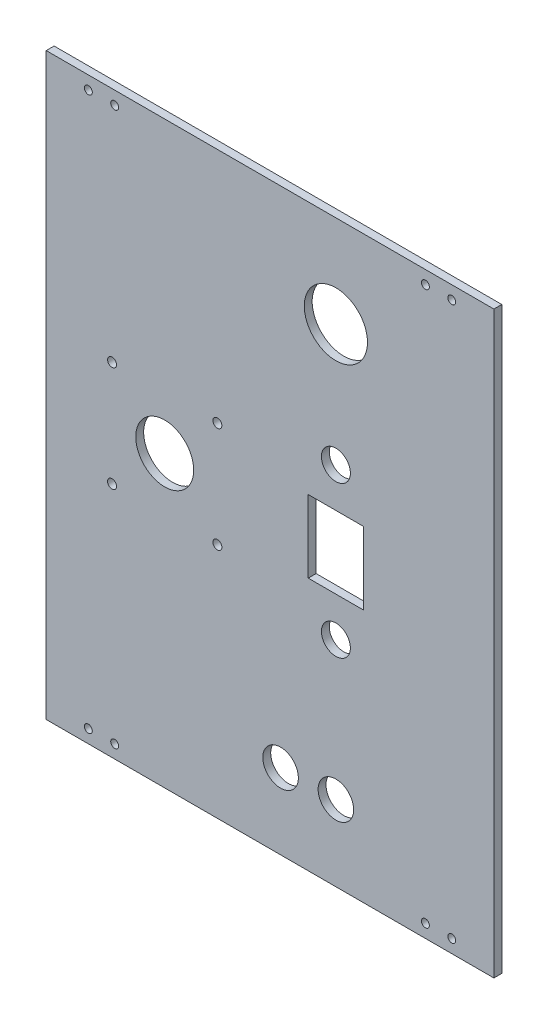
ISO-10303-21;
HEADER;
FILE_DESCRIPTION(('STEP AP214'),'2;1');
FILE_NAME('part.step','',(''),(''),'','','');
FILE_SCHEMA(('AUTOMOTIVE_DESIGN { 1 0 10303 214 1 1 1 1 }'));
ENDSEC;
DATA;
#1=APPLICATION_CONTEXT('core data for automotive mechanical design processes');
#2=APPLICATION_PROTOCOL_DEFINITION('international standard','automotive_design',2000,#1);
#3=PRODUCT_CONTEXT('',#1,'mechanical');
#4=PRODUCT('Part','Part','',(#3));
#5=PRODUCT_RELATED_PRODUCT_CATEGORY('part','',(#4));
#6=PRODUCT_DEFINITION_FORMATION('','',#4);
#7=PRODUCT_DEFINITION_CONTEXT('part definition',#1,'design');
#8=PRODUCT_DEFINITION('design','',#6,#7);
#9=PRODUCT_DEFINITION_SHAPE('','',#8);
#10=(LENGTH_UNIT() NAMED_UNIT(*) SI_UNIT(.MILLI.,.METRE.));
#11=(NAMED_UNIT(*) PLANE_ANGLE_UNIT() SI_UNIT($,.RADIAN.));
#12=(NAMED_UNIT(*) SI_UNIT($,.STERADIAN.) SOLID_ANGLE_UNIT());
#13=UNCERTAINTY_MEASURE_WITH_UNIT(LENGTH_MEASURE(1.E-05),#10,'distance_accuracy_value','');
#14=(GEOMETRIC_REPRESENTATION_CONTEXT(3) GLOBAL_UNCERTAINTY_ASSIGNED_CONTEXT((#13)) GLOBAL_UNIT_ASSIGNED_CONTEXT((#10,
#11,#12)) REPRESENTATION_CONTEXT('',''));
#15=CARTESIAN_POINT('',(0.,0.,0.));
#16=DIRECTION('',(0.,0.,1.));
#17=DIRECTION('',(1.,0.,0.));
#18=AXIS2_PLACEMENT_3D('',#15,#16,#17);
#19=CARTESIAN_POINT('',(99.8748036559118,-179.78014735229,3.));
#20=DIRECTION('',(0.,0.,-1.));
#21=DIRECTION('',(-1.,0.,0.));
#22=AXIS2_PLACEMENT_3D('',#19,#20,#21);
#23=PLANE('',#22);
#24=CARTESIAN_POINT('',(18.8748036559118,-151.105010126258,3.));
#25=DIRECTION('',(0.,0.,1.));
#26=DIRECTION('',(1.,0.,0.));
#27=AXIS2_PLACEMENT_3D('',#24,#25,#26);
#28=CIRCLE('',#27,6.75);
#29=CARTESIAN_POINT('',(25.6248036559118,-151.105010126258,3.));
#30=VERTEX_POINT('',#29);
#31=EDGE_CURVE('E325',#30,#30,#28,.T.);
#32=ORIENTED_EDGE('',*,*,#31,.F.);
#33=EDGE_LOOP('',(#32));
#34=FACE_BOUND('',#33,.T.);
#35=CARTESIAN_POINT('',(39.8748036559118,-98.5301473522896,3.));
#36=DIRECTION('',(0.,0.,1.));
#37=DIRECTION('',(-1.,0.,0.));
#38=AXIS2_PLACEMENT_3D('',#35,#36,#37);
#39=CIRCLE('',#38,5.49999999999999);
#40=CARTESIAN_POINT('',(34.3748036559118,-98.5301473522896,3.));
#41=VERTEX_POINT('',#40);
#42=EDGE_CURVE('E335',#41,#41,#39,.T.);
#43=ORIENTED_EDGE('',*,*,#42,.F.);
#44=EDGE_LOOP('',(#43));
#45=FACE_BOUND('',#44,.T.);
#46=DIRECTION('',(0.,1.,0.));
#47=VECTOR('',#46,1.);
#48=CARTESIAN_POINT('',(50.3748036559118,-56.0301473522896,3.));
#49=LINE('',#48,#47);
#50=CARTESIAN_POINT('',(50.3748036559118,-83.5301473522896,3.));
#51=VERTEX_POINT('',#50);
#52=CARTESIAN_POINT('',(50.3748036559118,-56.0301473522896,3.));
#53=VERTEX_POINT('',#52);
#54=EDGE_CURVE('E98',#51,#53,#49,.T.);
#55=ORIENTED_EDGE('',*,*,#54,.F.);
#56=DIRECTION('',(1.,0.,0.));
#57=VECTOR('',#56,1.);
#58=CARTESIAN_POINT('',(50.3748036559118,-83.5301473522896,3.));
#59=LINE('',#58,#57);
#60=CARTESIAN_POINT('',(29.3748036559118,-83.5301473522896,3.));
#61=VERTEX_POINT('',#60);
#62=EDGE_CURVE('E121',#61,#51,#59,.T.);
#63=ORIENTED_EDGE('',*,*,#62,.F.);
#64=DIRECTION('',(0.,-1.,0.));
#65=VECTOR('',#64,1.);
#66=CARTESIAN_POINT('',(29.3748036559118,-56.0301473522896,3.));
#67=LINE('',#66,#65);
#68=CARTESIAN_POINT('',(29.3748036559118,-56.0301473522896,3.));
#69=VERTEX_POINT('',#68);
#70=EDGE_CURVE('E119',#69,#61,#67,.T.);
#71=ORIENTED_EDGE('',*,*,#70,.F.);
#72=DIRECTION('',(-1.,0.,0.));
#73=VECTOR('',#72,1.);
#74=CARTESIAN_POINT('',(50.3748036559118,-56.0301473522896,3.));
#75=LINE('',#74,#73);
#76=EDGE_CURVE('E106',#53,#69,#75,.T.);
#77=ORIENTED_EDGE('',*,*,#76,.F.);
#78=EDGE_LOOP('',(#55,#63,#71,#77));
#79=FACE_BOUND('',#78,.T.);
#80=CARTESIAN_POINT('',(-54.1251963440883,35.2198526477105,3.));
#81=DIRECTION('',(0.,0.,1.));
#82=DIRECTION('',(1.,0.,0.));
#83=AXIS2_PLACEMENT_3D('',#80,#81,#82);
#84=CIRCLE('',#83,1.5);
#85=CARTESIAN_POINT('',(-52.6251963440883,35.2198526477105,3.));
#86=VERTEX_POINT('',#85);
#87=EDGE_CURVE('E143',#86,#86,#84,.T.);
#88=ORIENTED_EDGE('',*,*,#87,.F.);
#89=EDGE_LOOP('',(#88));
#90=FACE_BOUND('',#89,.T.);
#91=CARTESIAN_POINT('',(-54.1251963440883,-174.78014735229,3.));
#92=DIRECTION('',(0.,0.,1.));
#93=DIRECTION('',(-1.,0.,0.));
#94=AXIS2_PLACEMENT_3D('',#91,#92,#93);
#95=CIRCLE('',#94,1.5);
#96=CARTESIAN_POINT('',(-55.6251963440883,-174.78014735229,3.));
#97=VERTEX_POINT('',#96);
#98=EDGE_CURVE('E155',#97,#97,#95,.T.);
#99=ORIENTED_EDGE('',*,*,#98,.F.);
#100=EDGE_LOOP('',(#99));
#101=FACE_BOUND('',#100,.T.);
#102=CARTESIAN_POINT('',(73.8748036559118,35.2198526477105,3.));
#103=DIRECTION('',(0.,0.,1.));
#104=DIRECTION('',(-1.,0.,0.));
#105=AXIS2_PLACEMENT_3D('',#102,#103,#104);
#106=CIRCLE('',#105,1.5);
#107=CARTESIAN_POINT('',(72.3748036559118,35.2198526477105,3.));
#108=VERTEX_POINT('',#107);
#109=EDGE_CURVE('E167',#108,#108,#106,.T.);
#110=ORIENTED_EDGE('',*,*,#109,.F.);
#111=EDGE_LOOP('',(#110));
#112=FACE_BOUND('',#111,.T.);
#113=CARTESIAN_POINT('',(73.8748036559118,-174.78014735229,3.));
#114=DIRECTION('',(0.,0.,1.));
#115=DIRECTION('',(1.,0.,0.));
#116=AXIS2_PLACEMENT_3D('',#113,#114,#115);
#117=CIRCLE('',#116,1.5);
#118=CARTESIAN_POINT('',(75.3748036559118,-174.78014735229,3.));
#119=VERTEX_POINT('',#118);
#120=EDGE_CURVE('E179',#119,#119,#117,.T.);
#121=ORIENTED_EDGE('',*,*,#120,.F.);
#122=EDGE_LOOP('',(#121));
#123=FACE_BOUND('',#122,.T.);
#124=CARTESIAN_POINT('',(-45.1251963440883,-89.7801473522896,3.));
#125=DIRECTION('',(0.,0.,1.));
#126=DIRECTION('',(1.,0.,0.));
#127=AXIS2_PLACEMENT_3D('',#124,#125,#126);
#128=CIRCLE('',#127,1.70000000000001);
#129=CARTESIAN_POINT('',(-43.4251963440883,-89.7801473522896,3.));
#130=VERTEX_POINT('',#129);
#131=EDGE_CURVE('E191',#130,#130,#128,.T.);
#132=ORIENTED_EDGE('',*,*,#131,.F.);
#133=EDGE_LOOP('',(#132));
#134=FACE_BOUND('',#133,.T.);
#135=CARTESIAN_POINT('',(-5.12519634408823,-89.7801473522895,3.));
#136=DIRECTION('',(0.,0.,1.));
#137=DIRECTION('',(1.,0.,0.));
#138=AXIS2_PLACEMENT_3D('',#135,#136,#137);
#139=CIRCLE('',#138,1.70000000000001);
#140=CARTESIAN_POINT('',(-3.42519634408822,-89.7801473522895,3.));
#141=VERTEX_POINT('',#140);
#142=EDGE_CURVE('E203',#141,#141,#139,.T.);
#143=ORIENTED_EDGE('',*,*,#142,.F.);
#144=EDGE_LOOP('',(#143));
#145=FACE_BOUND('',#144,.T.);
#146=DIRECTION('',(0.,1.,0.));
#147=VECTOR('',#146,1.);
#148=CARTESIAN_POINT('',(99.8748036559118,40.2198526477105,3.));
#149=LINE('',#148,#147);
#150=CARTESIAN_POINT('',(99.8748036559118,-179.78014735229,3.));
#151=VERTEX_POINT('',#150);
#152=CARTESIAN_POINT('',(99.8748036559118,40.2198526477105,3.));
#153=VERTEX_POINT('',#152);
#154=EDGE_CURVE('E215',#151,#153,#149,.T.);
#155=ORIENTED_EDGE('',*,*,#154,.T.);
#156=DIRECTION('',(-1.,0.,0.));
#157=VECTOR('',#156,1.);
#158=CARTESIAN_POINT('',(99.8748036559118,40.2198526477105,3.));
#159=LINE('',#158,#157);
#160=CARTESIAN_POINT('',(-70.1251963440883,40.2198526477104,3.));
#161=VERTEX_POINT('',#160);
#162=EDGE_CURVE('E218',#153,#161,#159,.T.);
#163=ORIENTED_EDGE('',*,*,#162,.T.);
#164=DIRECTION('',(0.,-1.,0.));
#165=VECTOR('',#164,1.);
#166=CARTESIAN_POINT('',(-70.1251963440883,40.2198526477104,3.));
#167=LINE('',#166,#165);
#168=CARTESIAN_POINT('',(-70.1251963440882,-179.78014735229,3.));
#169=VERTEX_POINT('',#168);
#170=EDGE_CURVE('E221',#161,#169,#167,.T.);
#171=ORIENTED_EDGE('',*,*,#170,.T.);
#172=DIRECTION('',(1.,0.,0.));
#173=VECTOR('',#172,1.);
#174=CARTESIAN_POINT('',(99.8748036559118,-179.78014735229,3.));
#175=LINE('',#174,#173);
#176=EDGE_CURVE('E223',#169,#151,#175,.T.);
#177=ORIENTED_EDGE('',*,*,#176,.T.);
#178=EDGE_LOOP('',(#155,#163,#171,#177));
#179=FACE_BOUND('',#178,.T.);
#180=CARTESIAN_POINT('',(-25.1251963440882,-69.7801473522895,3.));
#181=DIRECTION('',(0.,0.,1.));
#182=DIRECTION('',(1.,0.,0.));
#183=AXIS2_PLACEMENT_3D('',#180,#181,#182);
#184=CIRCLE('',#183,11.);
#185=CARTESIAN_POINT('',(-14.1251963440882,-69.7801473522895,3.));
#186=VERTEX_POINT('',#185);
#187=EDGE_CURVE('E209',#186,#186,#184,.T.);
#188=ORIENTED_EDGE('',*,*,#187,.F.);
#189=EDGE_LOOP('',(#188));
#190=FACE_BOUND('',#189,.T.);
#191=CARTESIAN_POINT('',(83.8748036559118,-174.78014735229,3.));
#192=DIRECTION('',(0.,0.,1.));
#193=DIRECTION('',(1.,0.,0.));
#194=AXIS2_PLACEMENT_3D('',#191,#192,#193);
#195=CIRCLE('',#194,1.5);
#196=CARTESIAN_POINT('',(85.3748036559118,-174.78014735229,3.));
#197=VERTEX_POINT('',#196);
#198=EDGE_CURVE('E197',#197,#197,#195,.T.);
#199=ORIENTED_EDGE('',*,*,#198,.F.);
#200=EDGE_LOOP('',(#199));
#201=FACE_BOUND('',#200,.T.);
#202=CARTESIAN_POINT('',(-45.1251963440883,-49.7801473522896,3.));
#203=DIRECTION('',(0.,0.,1.));
#204=DIRECTION('',(1.,0.,0.));
#205=AXIS2_PLACEMENT_3D('',#202,#203,#204);
#206=CIRCLE('',#205,1.7);
#207=CARTESIAN_POINT('',(-43.4251963440883,-49.7801473522896,3.));
#208=VERTEX_POINT('',#207);
#209=EDGE_CURVE('E185',#208,#208,#206,.T.);
#210=ORIENTED_EDGE('',*,*,#209,.F.);
#211=EDGE_LOOP('',(#210));
#212=FACE_BOUND('',#211,.T.);
#213=CARTESIAN_POINT('',(83.8748036559118,35.2198526477105,3.));
#214=DIRECTION('',(0.,0.,1.));
#215=DIRECTION('',(-1.,0.,0.));
#216=AXIS2_PLACEMENT_3D('',#213,#214,#215);
#217=CIRCLE('',#216,1.5);
#218=CARTESIAN_POINT('',(82.3748036559118,35.2198526477105,3.));
#219=VERTEX_POINT('',#218);
#220=EDGE_CURVE('E173',#219,#219,#217,.T.);
#221=ORIENTED_EDGE('',*,*,#220,.F.);
#222=EDGE_LOOP('',(#221));
#223=FACE_BOUND('',#222,.T.);
#224=CARTESIAN_POINT('',(-44.1251963440883,-174.78014735229,3.));
#225=DIRECTION('',(0.,0.,1.));
#226=DIRECTION('',(-1.,0.,0.));
#227=AXIS2_PLACEMENT_3D('',#224,#225,#226);
#228=CIRCLE('',#227,1.5);
#229=CARTESIAN_POINT('',(-45.6251963440883,-174.78014735229,3.));
#230=VERTEX_POINT('',#229);
#231=EDGE_CURVE('E161',#230,#230,#228,.T.);
#232=ORIENTED_EDGE('',*,*,#231,.F.);
#233=EDGE_LOOP('',(#232));
#234=FACE_BOUND('',#233,.T.);
#235=CARTESIAN_POINT('',(-44.1251963440883,35.2198526477105,3.));
#236=DIRECTION('',(0.,0.,1.));
#237=DIRECTION('',(1.,0.,0.));
#238=AXIS2_PLACEMENT_3D('',#235,#236,#237);
#239=CIRCLE('',#238,1.5);
#240=CARTESIAN_POINT('',(-42.6251963440883,35.2198526477105,3.));
#241=VERTEX_POINT('',#240);
#242=EDGE_CURVE('E149',#241,#241,#239,.T.);
#243=ORIENTED_EDGE('',*,*,#242,.F.);
#244=EDGE_LOOP('',(#243));
#245=FACE_BOUND('',#244,.T.);
#246=CARTESIAN_POINT('',(39.8748036559118,5.21985264771043,3.));
#247=DIRECTION('',(0.,0.,1.));
#248=DIRECTION('',(1.,0.,0.));
#249=AXIS2_PLACEMENT_3D('',#246,#247,#248);
#250=CIRCLE('',#249,12.);
#251=CARTESIAN_POINT('',(51.8748036559118,5.21985264771043,3.));
#252=VERTEX_POINT('',#251);
#253=EDGE_CURVE('E137',#252,#252,#250,.T.);
#254=ORIENTED_EDGE('',*,*,#253,.F.);
#255=EDGE_LOOP('',(#254));
#256=FACE_BOUND('',#255,.T.);
#257=CARTESIAN_POINT('',(39.8748036559118,-41.0301473522896,3.));
#258=DIRECTION('',(0.,0.,1.));
#259=DIRECTION('',(1.,0.,0.));
#260=AXIS2_PLACEMENT_3D('',#257,#258,#259);
#261=CIRCLE('',#260,5.5);
#262=CARTESIAN_POINT('',(45.3748036559118,-41.0301473522896,3.));
#263=VERTEX_POINT('',#262);
#264=EDGE_CURVE('E127',#263,#263,#261,.T.);
#265=ORIENTED_EDGE('',*,*,#264,.F.);
#266=EDGE_LOOP('',(#265));
#267=FACE_BOUND('',#266,.T.);
#268=CARTESIAN_POINT('',(39.8748036559118,-151.105010126258,3.));
#269=DIRECTION('',(0.,0.,1.));
#270=DIRECTION('',(1.,0.,0.));
#271=AXIS2_PLACEMENT_3D('',#268,#269,#270);
#272=CIRCLE('',#271,6.75);
#273=CARTESIAN_POINT('',(46.6248036559118,-151.105010126258,3.));
#274=VERTEX_POINT('',#273);
#275=EDGE_CURVE('E330',#274,#274,#272,.T.);
#276=ORIENTED_EDGE('',*,*,#275,.F.);
#277=EDGE_LOOP('',(#276));
#278=FACE_BOUND('',#277,.T.);
#279=CARTESIAN_POINT('',(-5.1251963440883,-49.7801473522896,3.));
#280=DIRECTION('',(0.,0.,1.));
#281=DIRECTION('',(1.,0.,0.));
#282=AXIS2_PLACEMENT_3D('',#279,#280,#281);
#283=CIRCLE('',#282,1.70000000000001);
#284=CARTESIAN_POINT('',(-3.42519634408829,-49.7801473522896,3.));
#285=VERTEX_POINT('',#284);
#286=EDGE_CURVE('E319',#285,#285,#283,.T.);
#287=ORIENTED_EDGE('',*,*,#286,.F.);
#288=EDGE_LOOP('',(#287));
#289=FACE_BOUND('',#288,.T.);
#290=ADVANCED_FACE('F33',(#34,#45,#79,#90,#101,#112,#123,#134,#145,#179,#190,#201,#212,#223,
#234,#245,#256,#267,#278,#289),#23,.F.);
#291=CARTESIAN_POINT('',(99.8748036559118,-179.78014735229,0.));
#292=DIRECTION('',(0.,0.,-1.));
#293=DIRECTION('',(-1.,0.,0.));
#294=AXIS2_PLACEMENT_3D('',#291,#292,#293);
#295=PLANE('',#294);
#296=CARTESIAN_POINT('',(18.8748036559118,-151.105010126258,0.));
#297=DIRECTION('',(0.,0.,1.));
#298=DIRECTION('',(1.,0.,0.));
#299=AXIS2_PLACEMENT_3D('',#296,#297,#298);
#300=CIRCLE('',#299,6.75);
#301=CARTESIAN_POINT('',(25.6248036559118,-151.105010126258,0.));
#302=VERTEX_POINT('',#301);
#303=EDGE_CURVE('E322',#302,#302,#300,.T.);
#304=ORIENTED_EDGE('',*,*,#303,.T.);
#305=EDGE_LOOP('',(#304));
#306=FACE_BOUND('',#305,.T.);
#307=CARTESIAN_POINT('',(39.8748036559118,-98.5301473522896,0.));
#308=DIRECTION('',(0.,0.,1.));
#309=DIRECTION('',(-1.,0.,0.));
#310=AXIS2_PLACEMENT_3D('',#307,#308,#309);
#311=CIRCLE('',#310,5.49999999999999);
#312=CARTESIAN_POINT('',(34.3748036559118,-98.5301473522896,0.));
#313=VERTEX_POINT('',#312);
#314=EDGE_CURVE('E333',#313,#313,#311,.T.);
#315=ORIENTED_EDGE('',*,*,#314,.T.);
#316=EDGE_LOOP('',(#315));
#317=FACE_BOUND('',#316,.T.);
#318=DIRECTION('',(1.,0.,0.));
#319=VECTOR('',#318,1.);
#320=CARTESIAN_POINT('',(50.3748036559118,-83.5301473522896,0.));
#321=LINE('',#320,#319);
#322=CARTESIAN_POINT('',(29.3748036559118,-83.5301473522896,0.));
#323=VERTEX_POINT('',#322);
#324=CARTESIAN_POINT('',(50.3748036559118,-83.5301473522896,0.));
#325=VERTEX_POINT('',#324);
#326=EDGE_CURVE('E107',#323,#325,#321,.T.);
#327=ORIENTED_EDGE('',*,*,#326,.T.);
#328=DIRECTION('',(0.,1.,0.));
#329=VECTOR('',#328,1.);
#330=CARTESIAN_POINT('',(50.3748036559118,-56.0301473522896,0.));
#331=LINE('',#330,#329);
#332=CARTESIAN_POINT('',(50.3748036559118,-56.0301473522896,0.));
#333=VERTEX_POINT('',#332);
#334=EDGE_CURVE('E56',#325,#333,#331,.T.);
#335=ORIENTED_EDGE('',*,*,#334,.T.);
#336=DIRECTION('',(-1.,0.,0.));
#337=VECTOR('',#336,1.);
#338=CARTESIAN_POINT('',(50.3748036559118,-56.0301473522896,0.));
#339=LINE('',#338,#337);
#340=CARTESIAN_POINT('',(29.3748036559118,-56.0301473522896,0.));
#341=VERTEX_POINT('',#340);
#342=EDGE_CURVE('E113',#333,#341,#339,.T.);
#343=ORIENTED_EDGE('',*,*,#342,.T.);
#344=DIRECTION('',(0.,-1.,0.));
#345=VECTOR('',#344,1.);
#346=CARTESIAN_POINT('',(29.3748036559118,-56.0301473522896,0.));
#347=LINE('',#346,#345);
#348=EDGE_CURVE('E129',#341,#323,#347,.T.);
#349=ORIENTED_EDGE('',*,*,#348,.T.);
#350=EDGE_LOOP('',(#327,#335,#343,#349));
#351=FACE_BOUND('',#350,.T.);
#352=CARTESIAN_POINT('',(-54.1251963440883,35.2198526477105,0.));
#353=DIRECTION('',(0.,0.,1.));
#354=DIRECTION('',(1.,0.,0.));
#355=AXIS2_PLACEMENT_3D('',#352,#353,#354);
#356=CIRCLE('',#355,1.5);
#357=CARTESIAN_POINT('',(-52.6251963440883,35.2198526477105,0.));
#358=VERTEX_POINT('',#357);
#359=EDGE_CURVE('E140',#358,#358,#356,.T.);
#360=ORIENTED_EDGE('',*,*,#359,.T.);
#361=EDGE_LOOP('',(#360));
#362=FACE_BOUND('',#361,.T.);
#363=CARTESIAN_POINT('',(-54.1251963440883,-174.78014735229,0.));
#364=DIRECTION('',(0.,0.,1.));
#365=DIRECTION('',(-1.,0.,0.));
#366=AXIS2_PLACEMENT_3D('',#363,#364,#365);
#367=CIRCLE('',#366,1.5);
#368=CARTESIAN_POINT('',(-55.6251963440883,-174.78014735229,0.));
#369=VERTEX_POINT('',#368);
#370=EDGE_CURVE('E152',#369,#369,#367,.T.);
#371=ORIENTED_EDGE('',*,*,#370,.T.);
#372=EDGE_LOOP('',(#371));
#373=FACE_BOUND('',#372,.T.);
#374=CARTESIAN_POINT('',(73.8748036559118,35.2198526477105,0.));
#375=DIRECTION('',(0.,0.,1.));
#376=DIRECTION('',(-1.,0.,0.));
#377=AXIS2_PLACEMENT_3D('',#374,#375,#376);
#378=CIRCLE('',#377,1.5);
#379=CARTESIAN_POINT('',(72.3748036559118,35.2198526477105,0.));
#380=VERTEX_POINT('',#379);
#381=EDGE_CURVE('E164',#380,#380,#378,.T.);
#382=ORIENTED_EDGE('',*,*,#381,.T.);
#383=EDGE_LOOP('',(#382));
#384=FACE_BOUND('',#383,.T.);
#385=CARTESIAN_POINT('',(73.8748036559118,-174.78014735229,0.));
#386=DIRECTION('',(0.,0.,1.));
#387=DIRECTION('',(1.,0.,0.));
#388=AXIS2_PLACEMENT_3D('',#385,#386,#387);
#389=CIRCLE('',#388,1.5);
#390=CARTESIAN_POINT('',(75.3748036559118,-174.78014735229,0.));
#391=VERTEX_POINT('',#390);
#392=EDGE_CURVE('E176',#391,#391,#389,.T.);
#393=ORIENTED_EDGE('',*,*,#392,.T.);
#394=EDGE_LOOP('',(#393));
#395=FACE_BOUND('',#394,.T.);
#396=CARTESIAN_POINT('',(-45.1251963440883,-89.7801473522896,0.));
#397=DIRECTION('',(0.,0.,1.));
#398=DIRECTION('',(1.,0.,0.));
#399=AXIS2_PLACEMENT_3D('',#396,#397,#398);
#400=CIRCLE('',#399,1.70000000000001);
#401=CARTESIAN_POINT('',(-43.4251963440883,-89.7801473522896,0.));
#402=VERTEX_POINT('',#401);
#403=EDGE_CURVE('E188',#402,#402,#400,.T.);
#404=ORIENTED_EDGE('',*,*,#403,.T.);
#405=EDGE_LOOP('',(#404));
#406=FACE_BOUND('',#405,.T.);
#407=CARTESIAN_POINT('',(-5.12519634408823,-89.7801473522895,0.));
#408=DIRECTION('',(0.,0.,1.));
#409=DIRECTION('',(1.,0.,0.));
#410=AXIS2_PLACEMENT_3D('',#407,#408,#409);
#411=CIRCLE('',#410,1.70000000000001);
#412=CARTESIAN_POINT('',(-3.42519634408822,-89.7801473522895,0.));
#413=VERTEX_POINT('',#412);
#414=EDGE_CURVE('E200',#413,#413,#411,.T.);
#415=ORIENTED_EDGE('',*,*,#414,.T.);
#416=EDGE_LOOP('',(#415));
#417=FACE_BOUND('',#416,.T.);
#418=DIRECTION('',(0.,1.,0.));
#419=VECTOR('',#418,1.);
#420=CARTESIAN_POINT('',(99.8748036559118,40.2198526477105,0.));
#421=LINE('',#420,#419);
#422=CARTESIAN_POINT('',(99.8748036559118,-179.78014735229,0.));
#423=VERTEX_POINT('',#422);
#424=CARTESIAN_POINT('',(99.8748036559118,40.2198526477105,0.));
#425=VERTEX_POINT('',#424);
#426=EDGE_CURVE('E212',#423,#425,#421,.T.);
#427=ORIENTED_EDGE('',*,*,#426,.F.);
#428=DIRECTION('',(1.,0.,0.));
#429=VECTOR('',#428,1.);
#430=CARTESIAN_POINT('',(99.8748036559118,-179.78014735229,0.));
#431=LINE('',#430,#429);
#432=CARTESIAN_POINT('',(-70.1251963440882,-179.78014735229,0.));
#433=VERTEX_POINT('',#432);
#434=EDGE_CURVE('E219',#433,#423,#431,.T.);
#435=ORIENTED_EDGE('',*,*,#434,.F.);
#436=DIRECTION('',(0.,-1.,0.));
#437=VECTOR('',#436,1.);
#438=CARTESIAN_POINT('',(-70.1251963440883,40.2198526477104,0.));
#439=LINE('',#438,#437);
#440=CARTESIAN_POINT('',(-70.1251963440883,40.2198526477104,0.));
#441=VERTEX_POINT('',#440);
#442=EDGE_CURVE('E230',#441,#433,#439,.T.);
#443=ORIENTED_EDGE('',*,*,#442,.F.);
#444=DIRECTION('',(-1.,0.,0.));
#445=VECTOR('',#444,1.);
#446=CARTESIAN_POINT('',(99.8748036559118,40.2198526477105,0.));
#447=LINE('',#446,#445);
#448=EDGE_CURVE('E228',#425,#441,#447,.T.);
#449=ORIENTED_EDGE('',*,*,#448,.F.);
#450=EDGE_LOOP('',(#427,#435,#443,#449));
#451=FACE_BOUND('',#450,.T.);
#452=CARTESIAN_POINT('',(-25.1251963440882,-69.7801473522895,0.));
#453=DIRECTION('',(0.,0.,1.));
#454=DIRECTION('',(1.,0.,0.));
#455=AXIS2_PLACEMENT_3D('',#452,#453,#454);
#456=CIRCLE('',#455,11.);
#457=CARTESIAN_POINT('',(-14.1251963440882,-69.7801473522895,0.));
#458=VERTEX_POINT('',#457);
#459=EDGE_CURVE('E206',#458,#458,#456,.T.);
#460=ORIENTED_EDGE('',*,*,#459,.T.);
#461=EDGE_LOOP('',(#460));
#462=FACE_BOUND('',#461,.T.);
#463=CARTESIAN_POINT('',(83.8748036559118,-174.78014735229,0.));
#464=DIRECTION('',(0.,0.,1.));
#465=DIRECTION('',(1.,0.,0.));
#466=AXIS2_PLACEMENT_3D('',#463,#464,#465);
#467=CIRCLE('',#466,1.5);
#468=CARTESIAN_POINT('',(85.3748036559118,-174.78014735229,0.));
#469=VERTEX_POINT('',#468);
#470=EDGE_CURVE('E194',#469,#469,#467,.T.);
#471=ORIENTED_EDGE('',*,*,#470,.T.);
#472=EDGE_LOOP('',(#471));
#473=FACE_BOUND('',#472,.T.);
#474=CARTESIAN_POINT('',(-45.1251963440883,-49.7801473522896,0.));
#475=DIRECTION('',(0.,0.,1.));
#476=DIRECTION('',(1.,0.,0.));
#477=AXIS2_PLACEMENT_3D('',#474,#475,#476);
#478=CIRCLE('',#477,1.7);
#479=CARTESIAN_POINT('',(-43.4251963440883,-49.7801473522896,0.));
#480=VERTEX_POINT('',#479);
#481=EDGE_CURVE('E182',#480,#480,#478,.T.);
#482=ORIENTED_EDGE('',*,*,#481,.T.);
#483=EDGE_LOOP('',(#482));
#484=FACE_BOUND('',#483,.T.);
#485=CARTESIAN_POINT('',(83.8748036559118,35.2198526477105,0.));
#486=DIRECTION('',(0.,0.,1.));
#487=DIRECTION('',(-1.,0.,0.));
#488=AXIS2_PLACEMENT_3D('',#485,#486,#487);
#489=CIRCLE('',#488,1.5);
#490=CARTESIAN_POINT('',(82.3748036559118,35.2198526477105,0.));
#491=VERTEX_POINT('',#490);
#492=EDGE_CURVE('E170',#491,#491,#489,.T.);
#493=ORIENTED_EDGE('',*,*,#492,.T.);
#494=EDGE_LOOP('',(#493));
#495=FACE_BOUND('',#494,.T.);
#496=CARTESIAN_POINT('',(-44.1251963440883,-174.78014735229,0.));
#497=DIRECTION('',(0.,0.,1.));
#498=DIRECTION('',(-1.,0.,0.));
#499=AXIS2_PLACEMENT_3D('',#496,#497,#498);
#500=CIRCLE('',#499,1.5);
#501=CARTESIAN_POINT('',(-45.6251963440883,-174.78014735229,0.));
#502=VERTEX_POINT('',#501);
#503=EDGE_CURVE('E158',#502,#502,#500,.T.);
#504=ORIENTED_EDGE('',*,*,#503,.T.);
#505=EDGE_LOOP('',(#504));
#506=FACE_BOUND('',#505,.T.);
#507=CARTESIAN_POINT('',(-44.1251963440883,35.2198526477105,0.));
#508=DIRECTION('',(0.,0.,1.));
#509=DIRECTION('',(1.,0.,0.));
#510=AXIS2_PLACEMENT_3D('',#507,#508,#509);
#511=CIRCLE('',#510,1.5);
#512=CARTESIAN_POINT('',(-42.6251963440883,35.2198526477105,0.));
#513=VERTEX_POINT('',#512);
#514=EDGE_CURVE('E146',#513,#513,#511,.T.);
#515=ORIENTED_EDGE('',*,*,#514,.T.);
#516=EDGE_LOOP('',(#515));
#517=FACE_BOUND('',#516,.T.);
#518=CARTESIAN_POINT('',(39.8748036559118,5.21985264771043,0.));
#519=DIRECTION('',(0.,0.,1.));
#520=DIRECTION('',(1.,0.,0.));
#521=AXIS2_PLACEMENT_3D('',#518,#519,#520);
#522=CIRCLE('',#521,12.);
#523=CARTESIAN_POINT('',(51.8748036559118,5.21985264771043,0.));
#524=VERTEX_POINT('',#523);
#525=EDGE_CURVE('E114',#524,#524,#522,.T.);
#526=ORIENTED_EDGE('',*,*,#525,.T.);
#527=EDGE_LOOP('',(#526));
#528=FACE_BOUND('',#527,.T.);
#529=CARTESIAN_POINT('',(39.8748036559118,-41.0301473522896,0.));
#530=DIRECTION('',(0.,0.,1.));
#531=DIRECTION('',(1.,0.,0.));
#532=AXIS2_PLACEMENT_3D('',#529,#530,#531);
#533=CIRCLE('',#532,5.5);
#534=CARTESIAN_POINT('',(45.3748036559118,-41.0301473522896,0.));
#535=VERTEX_POINT('',#534);
#536=EDGE_CURVE('E310',#535,#535,#533,.T.);
#537=ORIENTED_EDGE('',*,*,#536,.T.);
#538=EDGE_LOOP('',(#537));
#539=FACE_BOUND('',#538,.T.);
#540=CARTESIAN_POINT('',(39.8748036559118,-151.105010126258,0.));
#541=DIRECTION('',(0.,0.,1.));
#542=DIRECTION('',(1.,0.,0.));
#543=AXIS2_PLACEMENT_3D('',#540,#541,#542);
#544=CIRCLE('',#543,6.75);
#545=CARTESIAN_POINT('',(46.6248036559118,-151.105010126258,0.));
#546=VERTEX_POINT('',#545);
#547=EDGE_CURVE('E314',#546,#546,#544,.T.);
#548=ORIENTED_EDGE('',*,*,#547,.T.);
#549=EDGE_LOOP('',(#548));
#550=FACE_BOUND('',#549,.T.);
#551=CARTESIAN_POINT('',(-5.1251963440883,-49.7801473522896,0.));
#552=DIRECTION('',(0.,0.,1.));
#553=DIRECTION('',(1.,0.,0.));
#554=AXIS2_PLACEMENT_3D('',#551,#552,#553);
#555=CIRCLE('',#554,1.70000000000001);
#556=CARTESIAN_POINT('',(-3.42519634408829,-49.7801473522896,0.));
#557=VERTEX_POINT('',#556);
#558=EDGE_CURVE('E317',#557,#557,#555,.T.);
#559=ORIENTED_EDGE('',*,*,#558,.T.);
#560=EDGE_LOOP('',(#559));
#561=FACE_BOUND('',#560,.T.);
#562=ADVANCED_FACE('F248',(#306,#317,#351,#362,#373,#384,#395,#406,#417,#451,#462,#473,#484,
#495,#506,#517,#528,#539,#550,#561),#295,.T.);
#563=CARTESIAN_POINT('',(99.8748036559118,40.2198526477105,3.));
#564=DIRECTION('',(-1.,0.,0.));
#565=DIRECTION('',(0.,0.,1.));
#566=AXIS2_PLACEMENT_3D('',#563,#564,#565);
#567=PLANE('',#566);
#568=ORIENTED_EDGE('',*,*,#426,.T.);
#569=DIRECTION('',(0.,0.,-1.));
#570=VECTOR('',#569,1.);
#571=CARTESIAN_POINT('',(99.8748036559118,40.2198526477105,3.));
#572=LINE('',#571,#570);
#573=EDGE_CURVE('E11',#153,#425,#572,.T.);
#574=ORIENTED_EDGE('',*,*,#573,.F.);
#575=ORIENTED_EDGE('',*,*,#154,.F.);
#576=DIRECTION('',(0.,0.,-1.));
#577=VECTOR('',#576,1.);
#578=CARTESIAN_POINT('',(99.8748036559118,-179.78014735229,3.));
#579=LINE('',#578,#577);
#580=EDGE_CURVE('E225',#151,#423,#579,.T.);
#581=ORIENTED_EDGE('',*,*,#580,.T.);
#582=EDGE_LOOP('',(#568,#574,#575,#581));
#583=FACE_BOUND('',#582,.T.);
#584=ADVANCED_FACE('F35',(#583),#567,.F.);
#585=CARTESIAN_POINT('',(99.8748036559118,40.2198526477105,3.));
#586=DIRECTION('',(0.,-1.,0.));
#587=DIRECTION('',(1.,0.,0.));
#588=AXIS2_PLACEMENT_3D('',#585,#586,#587);
#589=PLANE('',#588);
#590=ORIENTED_EDGE('',*,*,#448,.T.);
#591=DIRECTION('',(0.,0.,-1.));
#592=VECTOR('',#591,1.);
#593=CARTESIAN_POINT('',(-70.1251963440883,40.2198526477104,3.));
#594=LINE('',#593,#592);
#595=EDGE_CURVE('E41',#161,#441,#594,.T.);
#596=ORIENTED_EDGE('',*,*,#595,.F.);
#597=ORIENTED_EDGE('',*,*,#162,.F.);
#598=ORIENTED_EDGE('',*,*,#573,.T.);
#599=EDGE_LOOP('',(#590,#596,#597,#598));
#600=FACE_BOUND('',#599,.T.);
#601=ADVANCED_FACE('F259',(#600),#589,.F.);
#602=CARTESIAN_POINT('',(-70.1251963440883,40.2198526477104,3.));
#603=DIRECTION('',(1.,0.,0.));
#604=DIRECTION('',(0.,1.,0.));
#605=AXIS2_PLACEMENT_3D('',#602,#603,#604);
#606=PLANE('',#605);
#607=ORIENTED_EDGE('',*,*,#442,.T.);
#608=DIRECTION('',(0.,0.,-1.));
#609=VECTOR('',#608,1.);
#610=CARTESIAN_POINT('',(-70.1251963440882,-179.78014735229,3.));
#611=LINE('',#610,#609);
#612=EDGE_CURVE('E235',#169,#433,#611,.T.);
#613=ORIENTED_EDGE('',*,*,#612,.F.);
#614=ORIENTED_EDGE('',*,*,#170,.F.);
#615=ORIENTED_EDGE('',*,*,#595,.T.);
#616=EDGE_LOOP('',(#607,#613,#614,#615));
#617=FACE_BOUND('',#616,.T.);
#618=ADVANCED_FACE('F242',(#617),#606,.F.);
#619=CARTESIAN_POINT('',(99.8748036559118,-179.78014735229,3.));
#620=DIRECTION('',(0.,1.,0.));
#621=DIRECTION('',(-1.,0.,0.));
#622=AXIS2_PLACEMENT_3D('',#619,#620,#621);
#623=PLANE('',#622);
#624=ORIENTED_EDGE('',*,*,#434,.T.);
#625=ORIENTED_EDGE('',*,*,#580,.F.);
#626=ORIENTED_EDGE('',*,*,#176,.F.);
#627=ORIENTED_EDGE('',*,*,#612,.T.);
#628=EDGE_LOOP('',(#624,#625,#626,#627));
#629=FACE_BOUND('',#628,.T.);
#630=ADVANCED_FACE('F252',(#629),#623,.F.);
#631=CARTESIAN_POINT('',(-25.1251963440882,-69.7801473522895,3.));
#632=DIRECTION('',(0.,0.,-1.));
#633=DIRECTION('',(-1.,0.,0.));
#634=AXIS2_PLACEMENT_3D('',#631,#632,#633);
#635=CYLINDRICAL_SURFACE('',#634,11.);
#636=ORIENTED_EDGE('',*,*,#187,.T.);
#637=EDGE_LOOP('',(#636));
#638=FACE_BOUND('',#637,.T.);
#639=ORIENTED_EDGE('',*,*,#459,.F.);
#640=EDGE_LOOP('',(#639));
#641=FACE_BOUND('',#640,.T.);
#642=ADVANCED_FACE('F277',(#638,#641),#635,.F.);
#643=CARTESIAN_POINT('',(-5.12519634408823,-89.7801473522895,3.));
#644=DIRECTION('',(0.,0.,-1.));
#645=DIRECTION('',(-1.,0.,0.));
#646=AXIS2_PLACEMENT_3D('',#643,#644,#645);
#647=CYLINDRICAL_SURFACE('',#646,1.70000000000001);
#648=ORIENTED_EDGE('',*,*,#142,.T.);
#649=EDGE_LOOP('',(#648));
#650=FACE_BOUND('',#649,.T.);
#651=ORIENTED_EDGE('',*,*,#414,.F.);
#652=EDGE_LOOP('',(#651));
#653=FACE_BOUND('',#652,.T.);
#654=ADVANCED_FACE('F284',(#650,#653),#647,.F.);
#655=CARTESIAN_POINT('',(83.8748036559118,-174.78014735229,3.));
#656=DIRECTION('',(0.,0.,-1.));
#657=DIRECTION('',(-1.,0.,0.));
#658=AXIS2_PLACEMENT_3D('',#655,#656,#657);
#659=CYLINDRICAL_SURFACE('',#658,1.5);
#660=ORIENTED_EDGE('',*,*,#198,.T.);
#661=EDGE_LOOP('',(#660));
#662=FACE_BOUND('',#661,.T.);
#663=ORIENTED_EDGE('',*,*,#470,.F.);
#664=EDGE_LOOP('',(#663));
#665=FACE_BOUND('',#664,.T.);
#666=ADVANCED_FACE('F289',(#662,#665),#659,.F.);
#667=CARTESIAN_POINT('',(-45.1251963440883,-89.7801473522896,3.));
#668=DIRECTION('',(0.,0.,-1.));
#669=DIRECTION('',(-1.,0.,0.));
#670=AXIS2_PLACEMENT_3D('',#667,#668,#669);
#671=CYLINDRICAL_SURFACE('',#670,1.70000000000001);
#672=ORIENTED_EDGE('',*,*,#131,.T.);
#673=EDGE_LOOP('',(#672));
#674=FACE_BOUND('',#673,.T.);
#675=ORIENTED_EDGE('',*,*,#403,.F.);
#676=EDGE_LOOP('',(#675));
#677=FACE_BOUND('',#676,.T.);
#678=ADVANCED_FACE('F417',(#674,#677),#671,.F.);
#679=CARTESIAN_POINT('',(-45.1251963440883,-49.7801473522896,3.));
#680=DIRECTION('',(0.,0.,-1.));
#681=DIRECTION('',(-1.,0.,0.));
#682=AXIS2_PLACEMENT_3D('',#679,#680,#681);
#683=CYLINDRICAL_SURFACE('',#682,1.7);
#684=ORIENTED_EDGE('',*,*,#209,.T.);
#685=EDGE_LOOP('',(#684));
#686=FACE_BOUND('',#685,.T.);
#687=ORIENTED_EDGE('',*,*,#481,.F.);
#688=EDGE_LOOP('',(#687));
#689=FACE_BOUND('',#688,.T.);
#690=ADVANCED_FACE('F413',(#686,#689),#683,.F.);
#691=CARTESIAN_POINT('',(73.8748036559118,-174.78014735229,3.));
#692=DIRECTION('',(0.,0.,-1.));
#693=DIRECTION('',(-1.,0.,0.));
#694=AXIS2_PLACEMENT_3D('',#691,#692,#693);
#695=CYLINDRICAL_SURFACE('',#694,1.5);
#696=ORIENTED_EDGE('',*,*,#120,.T.);
#697=EDGE_LOOP('',(#696));
#698=FACE_BOUND('',#697,.T.);
#699=ORIENTED_EDGE('',*,*,#392,.F.);
#700=EDGE_LOOP('',(#699));
#701=FACE_BOUND('',#700,.T.);
#702=ADVANCED_FACE('F409',(#698,#701),#695,.F.);
#703=CARTESIAN_POINT('',(83.8748036559118,35.2198526477105,3.));
#704=DIRECTION('',(0.,0.,-1.));
#705=DIRECTION('',(-1.,0.,0.));
#706=AXIS2_PLACEMENT_3D('',#703,#704,#705);
#707=CYLINDRICAL_SURFACE('',#706,1.5);
#708=ORIENTED_EDGE('',*,*,#220,.T.);
#709=EDGE_LOOP('',(#708));
#710=FACE_BOUND('',#709,.T.);
#711=ORIENTED_EDGE('',*,*,#492,.F.);
#712=EDGE_LOOP('',(#711));
#713=FACE_BOUND('',#712,.T.);
#714=ADVANCED_FACE('F405',(#710,#713),#707,.F.);
#715=CARTESIAN_POINT('',(73.8748036559118,35.2198526477105,3.));
#716=DIRECTION('',(0.,0.,-1.));
#717=DIRECTION('',(-1.,0.,0.));
#718=AXIS2_PLACEMENT_3D('',#715,#716,#717);
#719=CYLINDRICAL_SURFACE('',#718,1.5);
#720=ORIENTED_EDGE('',*,*,#109,.T.);
#721=EDGE_LOOP('',(#720));
#722=FACE_BOUND('',#721,.T.);
#723=ORIENTED_EDGE('',*,*,#381,.F.);
#724=EDGE_LOOP('',(#723));
#725=FACE_BOUND('',#724,.T.);
#726=ADVANCED_FACE('F401',(#722,#725),#719,.F.);
#727=CARTESIAN_POINT('',(-44.1251963440883,-174.78014735229,3.));
#728=DIRECTION('',(0.,0.,-1.));
#729=DIRECTION('',(-1.,0.,0.));
#730=AXIS2_PLACEMENT_3D('',#727,#728,#729);
#731=CYLINDRICAL_SURFACE('',#730,1.5);
#732=ORIENTED_EDGE('',*,*,#231,.T.);
#733=EDGE_LOOP('',(#732));
#734=FACE_BOUND('',#733,.T.);
#735=ORIENTED_EDGE('',*,*,#503,.F.);
#736=EDGE_LOOP('',(#735));
#737=FACE_BOUND('',#736,.T.);
#738=ADVANCED_FACE('F397',(#734,#737),#731,.F.);
#739=CARTESIAN_POINT('',(-54.1251963440883,-174.78014735229,3.));
#740=DIRECTION('',(0.,0.,-1.));
#741=DIRECTION('',(-1.,0.,0.));
#742=AXIS2_PLACEMENT_3D('',#739,#740,#741);
#743=CYLINDRICAL_SURFACE('',#742,1.5);
#744=ORIENTED_EDGE('',*,*,#98,.T.);
#745=EDGE_LOOP('',(#744));
#746=FACE_BOUND('',#745,.T.);
#747=ORIENTED_EDGE('',*,*,#370,.F.);
#748=EDGE_LOOP('',(#747));
#749=FACE_BOUND('',#748,.T.);
#750=ADVANCED_FACE('F393',(#746,#749),#743,.F.);
#751=CARTESIAN_POINT('',(-44.1251963440883,35.2198526477105,3.));
#752=DIRECTION('',(0.,0.,-1.));
#753=DIRECTION('',(-1.,0.,0.));
#754=AXIS2_PLACEMENT_3D('',#751,#752,#753);
#755=CYLINDRICAL_SURFACE('',#754,1.5);
#756=ORIENTED_EDGE('',*,*,#242,.T.);
#757=EDGE_LOOP('',(#756));
#758=FACE_BOUND('',#757,.T.);
#759=ORIENTED_EDGE('',*,*,#514,.F.);
#760=EDGE_LOOP('',(#759));
#761=FACE_BOUND('',#760,.T.);
#762=ADVANCED_FACE('F389',(#758,#761),#755,.F.);
#763=CARTESIAN_POINT('',(-54.1251963440883,35.2198526477105,3.));
#764=DIRECTION('',(0.,0.,-1.));
#765=DIRECTION('',(-1.,0.,0.));
#766=AXIS2_PLACEMENT_3D('',#763,#764,#765);
#767=CYLINDRICAL_SURFACE('',#766,1.5);
#768=ORIENTED_EDGE('',*,*,#87,.T.);
#769=EDGE_LOOP('',(#768));
#770=FACE_BOUND('',#769,.T.);
#771=ORIENTED_EDGE('',*,*,#359,.F.);
#772=EDGE_LOOP('',(#771));
#773=FACE_BOUND('',#772,.T.);
#774=ADVANCED_FACE('F385',(#770,#773),#767,.F.);
#775=CARTESIAN_POINT('',(39.8748036559118,5.21985264771043,3.));
#776=DIRECTION('',(0.,0.,-1.));
#777=DIRECTION('',(-1.,0.,0.));
#778=AXIS2_PLACEMENT_3D('',#775,#776,#777);
#779=CYLINDRICAL_SURFACE('',#778,12.);
#780=ORIENTED_EDGE('',*,*,#253,.T.);
#781=EDGE_LOOP('',(#780));
#782=FACE_BOUND('',#781,.T.);
#783=ORIENTED_EDGE('',*,*,#525,.F.);
#784=EDGE_LOOP('',(#783));
#785=FACE_BOUND('',#784,.T.);
#786=ADVANCED_FACE('F382',(#782,#785),#779,.F.);
#787=CARTESIAN_POINT('',(50.3748036559118,-56.0301473522896,3.));
#788=DIRECTION('',(-1.,0.,0.));
#789=DIRECTION('',(0.,0.,1.));
#790=AXIS2_PLACEMENT_3D('',#787,#788,#789);
#791=PLANE('',#790);
#792=ORIENTED_EDGE('',*,*,#334,.F.);
#793=DIRECTION('',(0.,0.,-1.));
#794=VECTOR('',#793,1.);
#795=CARTESIAN_POINT('',(50.3748036559118,-83.5301473522896,3.));
#796=LINE('',#795,#794);
#797=EDGE_CURVE('E102',#51,#325,#796,.T.);
#798=ORIENTED_EDGE('',*,*,#797,.F.);
#799=ORIENTED_EDGE('',*,*,#54,.T.);
#800=DIRECTION('',(0.,0.,-1.));
#801=VECTOR('',#800,1.);
#802=CARTESIAN_POINT('',(50.3748036559118,-56.0301473522896,3.));
#803=LINE('',#802,#801);
#804=EDGE_CURVE('E101',#53,#333,#803,.T.);
#805=ORIENTED_EDGE('',*,*,#804,.T.);
#806=EDGE_LOOP('',(#792,#798,#799,#805));
#807=FACE_BOUND('',#806,.T.);
#808=ADVANCED_FACE('F100',(#807),#791,.T.);
#809=CARTESIAN_POINT('',(50.3748036559118,-56.0301473522896,3.));
#810=DIRECTION('',(0.,-1.,0.));
#811=DIRECTION('',(1.,0.,0.));
#812=AXIS2_PLACEMENT_3D('',#809,#810,#811);
#813=PLANE('',#812);
#814=ORIENTED_EDGE('',*,*,#342,.F.);
#815=ORIENTED_EDGE('',*,*,#804,.F.);
#816=ORIENTED_EDGE('',*,*,#76,.T.);
#817=DIRECTION('',(0.,0.,-1.));
#818=VECTOR('',#817,1.);
#819=CARTESIAN_POINT('',(29.3748036559118,-56.0301473522896,3.));
#820=LINE('',#819,#818);
#821=EDGE_CURVE('E115',#69,#341,#820,.T.);
#822=ORIENTED_EDGE('',*,*,#821,.T.);
#823=EDGE_LOOP('',(#814,#815,#816,#822));
#824=FACE_BOUND('',#823,.T.);
#825=ADVANCED_FACE('F110',(#824),#813,.T.);
#826=CARTESIAN_POINT('',(29.3748036559118,-56.0301473522896,3.));
#827=DIRECTION('',(1.,0.,0.));
#828=DIRECTION('',(0.,1.,0.));
#829=AXIS2_PLACEMENT_3D('',#826,#827,#828);
#830=PLANE('',#829);
#831=ORIENTED_EDGE('',*,*,#348,.F.);
#832=ORIENTED_EDGE('',*,*,#821,.F.);
#833=ORIENTED_EDGE('',*,*,#70,.T.);
#834=DIRECTION('',(0.,0.,-1.));
#835=VECTOR('',#834,1.);
#836=CARTESIAN_POINT('',(29.3748036559118,-83.5301473522896,3.));
#837=LINE('',#836,#835);
#838=EDGE_CURVE('E48',#61,#323,#837,.T.);
#839=ORIENTED_EDGE('',*,*,#838,.T.);
#840=EDGE_LOOP('',(#831,#832,#833,#839));
#841=FACE_BOUND('',#840,.T.);
#842=ADVANCED_FACE('F374',(#841),#830,.T.);
#843=CARTESIAN_POINT('',(50.3748036559118,-83.5301473522896,3.));
#844=DIRECTION('',(0.,1.,0.));
#845=DIRECTION('',(0.,0.,1.));
#846=AXIS2_PLACEMENT_3D('',#843,#844,#845);
#847=PLANE('',#846);
#848=ORIENTED_EDGE('',*,*,#326,.F.);
#849=ORIENTED_EDGE('',*,*,#838,.F.);
#850=ORIENTED_EDGE('',*,*,#62,.T.);
#851=ORIENTED_EDGE('',*,*,#797,.T.);
#852=EDGE_LOOP('',(#848,#849,#850,#851));
#853=FACE_BOUND('',#852,.T.);
#854=ADVANCED_FACE('F371',(#853),#847,.T.);
#855=CARTESIAN_POINT('',(39.8748036559118,-41.0301473522896,3.));
#856=DIRECTION('',(0.,0.,-1.));
#857=DIRECTION('',(-1.,0.,0.));
#858=AXIS2_PLACEMENT_3D('',#855,#856,#857);
#859=CYLINDRICAL_SURFACE('',#858,5.5);
#860=ORIENTED_EDGE('',*,*,#264,.T.);
#861=EDGE_LOOP('',(#860));
#862=FACE_BOUND('',#861,.T.);
#863=ORIENTED_EDGE('',*,*,#536,.F.);
#864=EDGE_LOOP('',(#863));
#865=FACE_BOUND('',#864,.T.);
#866=ADVANCED_FACE('F343',(#862,#865),#859,.F.);
#867=CARTESIAN_POINT('',(39.8748036559118,-98.5301473522896,3.));
#868=DIRECTION('',(0.,0.,-1.));
#869=DIRECTION('',(-1.,0.,0.));
#870=AXIS2_PLACEMENT_3D('',#867,#868,#869);
#871=CYLINDRICAL_SURFACE('',#870,5.49999999999999);
#872=ORIENTED_EDGE('',*,*,#42,.T.);
#873=EDGE_LOOP('',(#872));
#874=FACE_BOUND('',#873,.T.);
#875=ORIENTED_EDGE('',*,*,#314,.F.);
#876=EDGE_LOOP('',(#875));
#877=FACE_BOUND('',#876,.T.);
#878=ADVANCED_FACE('F364',(#874,#877),#871,.F.);
#879=CARTESIAN_POINT('',(39.8748036559118,-151.105010126258,3.));
#880=DIRECTION('',(0.,0.,-1.));
#881=DIRECTION('',(-1.,0.,0.));
#882=AXIS2_PLACEMENT_3D('',#879,#880,#881);
#883=CYLINDRICAL_SURFACE('',#882,6.75);
#884=ORIENTED_EDGE('',*,*,#275,.T.);
#885=EDGE_LOOP('',(#884));
#886=FACE_BOUND('',#885,.T.);
#887=ORIENTED_EDGE('',*,*,#547,.F.);
#888=EDGE_LOOP('',(#887));
#889=FACE_BOUND('',#888,.T.);
#890=ADVANCED_FACE('F358',(#886,#889),#883,.F.);
#891=CARTESIAN_POINT('',(18.8748036559118,-151.105010126258,3.));
#892=DIRECTION('',(0.,0.,-1.));
#893=DIRECTION('',(-1.,0.,0.));
#894=AXIS2_PLACEMENT_3D('',#891,#892,#893);
#895=CYLINDRICAL_SURFACE('',#894,6.75);
#896=ORIENTED_EDGE('',*,*,#31,.T.);
#897=EDGE_LOOP('',(#896));
#898=FACE_BOUND('',#897,.T.);
#899=ORIENTED_EDGE('',*,*,#303,.F.);
#900=EDGE_LOOP('',(#899));
#901=FACE_BOUND('',#900,.T.);
#902=ADVANCED_FACE('F353',(#898,#901),#895,.F.);
#903=CARTESIAN_POINT('',(-5.1251963440883,-49.7801473522896,3.));
#904=DIRECTION('',(0.,0.,-1.));
#905=DIRECTION('',(-1.,0.,0.));
#906=AXIS2_PLACEMENT_3D('',#903,#904,#905);
#907=CYLINDRICAL_SURFACE('',#906,1.70000000000001);
#908=ORIENTED_EDGE('',*,*,#286,.T.);
#909=EDGE_LOOP('',(#908));
#910=FACE_BOUND('',#909,.T.);
#911=ORIENTED_EDGE('',*,*,#558,.F.);
#912=EDGE_LOOP('',(#911));
#913=FACE_BOUND('',#912,.T.);
#914=ADVANCED_FACE('F351',(#910,#913),#907,.F.);
#915=CLOSED_SHELL('',(#290,#562,#584,#601,#618,#630,#642,#654,#666,#678,#690,#702,#714,#726,
#738,#750,#762,#774,#786,#808,#825,#842,#854,#866,#878,#890,#902,#914));
#916=MANIFOLD_SOLID_BREP('B2',#915);
#917=ADVANCED_BREP_SHAPE_REPRESENTATION('',(#18,#916),#14);
#918=SHAPE_DEFINITION_REPRESENTATION(#9,#917);
ENDSEC;
END-ISO-10303-21;
